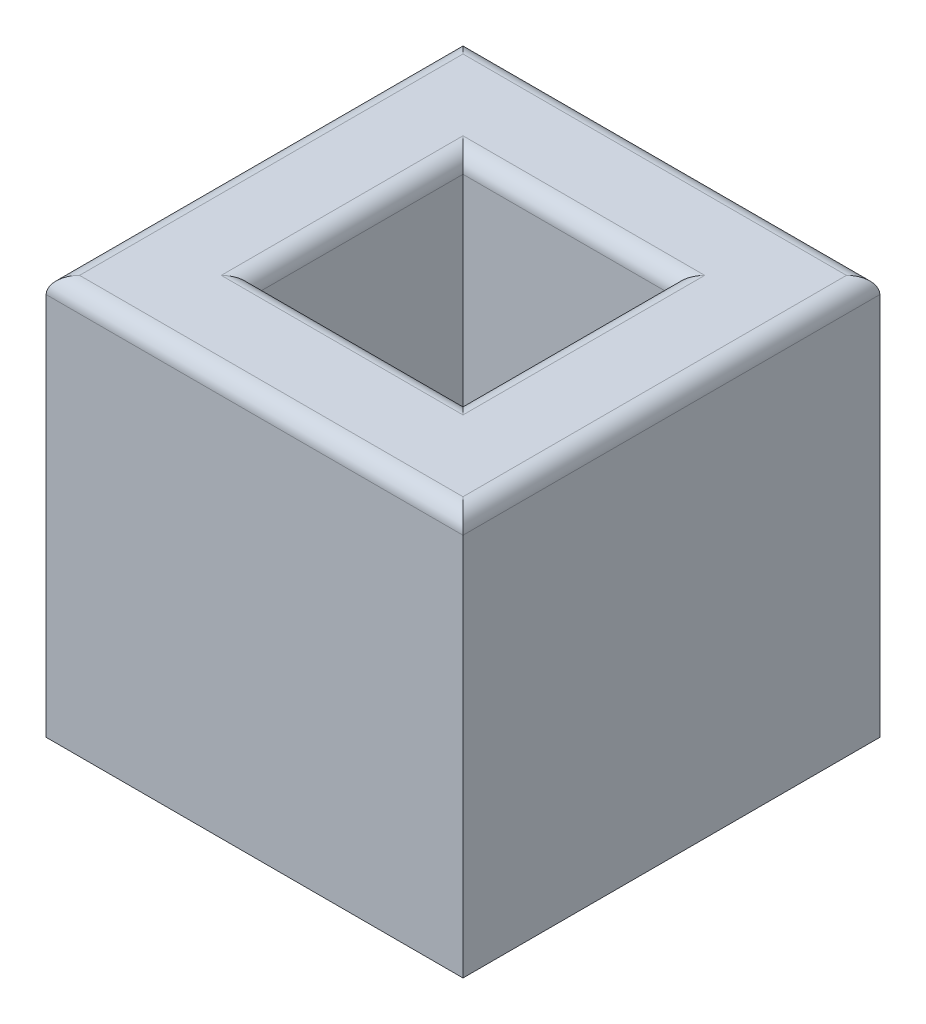
ISO-10303-21;
HEADER;
FILE_DESCRIPTION(('STEP AP214'),'2;1');
FILE_NAME('part.step','',(''),(''),'','','');
FILE_SCHEMA(('AUTOMOTIVE_DESIGN { 1 0 10303 214 1 1 1 1 }'));
ENDSEC;
DATA;
#1=APPLICATION_CONTEXT('core data for automotive mechanical design processes');
#2=APPLICATION_PROTOCOL_DEFINITION('international standard','automotive_design',2000,#1);
#3=PRODUCT_CONTEXT('',#1,'mechanical');
#4=PRODUCT('Part','Part','',(#3));
#5=PRODUCT_RELATED_PRODUCT_CATEGORY('part','',(#4));
#6=PRODUCT_DEFINITION_FORMATION('','',#4);
#7=PRODUCT_DEFINITION_CONTEXT('part definition',#1,'design');
#8=PRODUCT_DEFINITION('design','',#6,#7);
#9=PRODUCT_DEFINITION_SHAPE('','',#8);
#10=(LENGTH_UNIT() NAMED_UNIT(*) SI_UNIT(.MILLI.,.METRE.));
#11=(NAMED_UNIT(*) PLANE_ANGLE_UNIT() SI_UNIT($,.RADIAN.));
#12=(NAMED_UNIT(*) SI_UNIT($,.STERADIAN.) SOLID_ANGLE_UNIT());
#13=UNCERTAINTY_MEASURE_WITH_UNIT(LENGTH_MEASURE(1.E-05),#10,'distance_accuracy_value','');
#14=(GEOMETRIC_REPRESENTATION_CONTEXT(3) GLOBAL_UNCERTAINTY_ASSIGNED_CONTEXT((#13)) GLOBAL_UNIT_ASSIGNED_CONTEXT((#10,
#11,#12)) REPRESENTATION_CONTEXT('',''));
#15=CARTESIAN_POINT('',(0.,0.,0.));
#16=DIRECTION('',(0.,0.,1.));
#17=DIRECTION('',(1.,0.,0.));
#18=AXIS2_PLACEMENT_3D('',#15,#16,#17);
#19=CARTESIAN_POINT('',(63.5,127.,63.5));
#20=DIRECTION('',(-1.,0.,0.));
#21=DIRECTION('',(0.,0.,1.));
#22=AXIS2_PLACEMENT_3D('',#19,#20,#21);
#23=PLANE('',#22);
#24=DIRECTION('',(0.,-1.,0.));
#25=VECTOR('',#24,1.);
#26=CARTESIAN_POINT('',(63.5,127.,-63.5));
#27=LINE('',#26,#25);
#28=CARTESIAN_POINT('',(63.5,121.92,-63.5));
#29=VERTEX_POINT('',#28);
#30=CARTESIAN_POINT('',(63.5,5.08,-63.5));
#31=VERTEX_POINT('',#30);
#32=EDGE_CURVE('E161',#29,#31,#27,.T.);
#33=ORIENTED_EDGE('',*,*,#32,.F.);
#34=DIRECTION('',(0.,0.,-1.));
#35=VECTOR('',#34,1.);
#36=CARTESIAN_POINT('',(63.5,121.92,63.5));
#37=LINE('',#36,#35);
#38=CARTESIAN_POINT('',(63.5,121.92,63.5));
#39=VERTEX_POINT('',#38);
#40=EDGE_CURVE('E259',#29,#39,#37,.F.);
#41=ORIENTED_EDGE('',*,*,#40,.T.);
#42=DIRECTION('',(0.,-1.,0.));
#43=VECTOR('',#42,1.);
#44=CARTESIAN_POINT('',(63.5,127.,63.5));
#45=LINE('',#44,#43);
#46=CARTESIAN_POINT('',(63.5,5.08,63.5));
#47=VERTEX_POINT('',#46);
#48=EDGE_CURVE('E311',#39,#47,#45,.T.);
#49=ORIENTED_EDGE('',*,*,#48,.T.);
#50=DIRECTION('',(0.,0.,-1.));
#51=VECTOR('',#50,1.);
#52=CARTESIAN_POINT('',(63.5,5.08,-63.5));
#53=LINE('',#52,#51);
#54=EDGE_CURVE('E208',#47,#31,#53,.T.);
#55=ORIENTED_EDGE('',*,*,#54,.T.);
#56=EDGE_LOOP('',(#33,#41,#49,#55));
#57=FACE_BOUND('',#56,.T.);
#58=ADVANCED_FACE('F33',(#57),#23,.F.);
#59=CARTESIAN_POINT('',(-63.5,127.,-63.5));
#60=DIRECTION('',(0.,0.,1.));
#61=DIRECTION('',(1.,0.,0.));
#62=AXIS2_PLACEMENT_3D('',#59,#60,#61);
#63=PLANE('',#62);
#64=DIRECTION('',(0.,-1.,0.));
#65=VECTOR('',#64,1.);
#66=CARTESIAN_POINT('',(-63.5,127.,-63.5));
#67=LINE('',#66,#65);
#68=CARTESIAN_POINT('',(-63.5,121.92,-63.5));
#69=VERTEX_POINT('',#68);
#70=CARTESIAN_POINT('',(-63.5,5.08,-63.5));
#71=VERTEX_POINT('',#70);
#72=EDGE_CURVE('E149',#69,#71,#67,.T.);
#73=ORIENTED_EDGE('',*,*,#72,.F.);
#74=DIRECTION('',(-1.,0.,0.));
#75=VECTOR('',#74,1.);
#76=CARTESIAN_POINT('',(-63.5,121.92,-63.5));
#77=LINE('',#76,#75);
#78=EDGE_CURVE('E257',#69,#29,#77,.F.);
#79=ORIENTED_EDGE('',*,*,#78,.T.);
#80=ORIENTED_EDGE('',*,*,#32,.T.);
#81=DIRECTION('',(-1.,0.,0.));
#82=VECTOR('',#81,1.);
#83=CARTESIAN_POINT('',(-63.5,5.08,-63.5));
#84=LINE('',#83,#82);
#85=EDGE_CURVE('E170',#31,#71,#84,.T.);
#86=ORIENTED_EDGE('',*,*,#85,.T.);
#87=EDGE_LOOP('',(#73,#79,#80,#86));
#88=FACE_BOUND('',#87,.T.);
#89=ADVANCED_FACE('F184',(#88),#63,.F.);
#90=CARTESIAN_POINT('',(-63.5,127.,63.5));
#91=DIRECTION('',(1.,0.,0.));
#92=DIRECTION('',(0.,0.,-1.));
#93=AXIS2_PLACEMENT_3D('',#90,#91,#92);
#94=PLANE('',#93);
#95=DIRECTION('',(0.,-1.,0.));
#96=VECTOR('',#95,1.);
#97=CARTESIAN_POINT('',(-63.5,127.,63.5));
#98=LINE('',#97,#96);
#99=CARTESIAN_POINT('',(-63.5,121.92,63.5));
#100=VERTEX_POINT('',#99);
#101=CARTESIAN_POINT('',(-63.5,5.08,63.5));
#102=VERTEX_POINT('',#101);
#103=EDGE_CURVE('E162',#100,#102,#98,.T.);
#104=ORIENTED_EDGE('',*,*,#103,.F.);
#105=DIRECTION('',(0.,0.,1.));
#106=VECTOR('',#105,1.);
#107=CARTESIAN_POINT('',(-63.5,121.92,63.5));
#108=LINE('',#107,#106);
#109=EDGE_CURVE('E157',#100,#69,#108,.F.);
#110=ORIENTED_EDGE('',*,*,#109,.T.);
#111=ORIENTED_EDGE('',*,*,#72,.T.);
#112=DIRECTION('',(0.,0.,1.));
#113=VECTOR('',#112,1.);
#114=CARTESIAN_POINT('',(-63.5,5.08,63.5));
#115=LINE('',#114,#113);
#116=EDGE_CURVE('E154',#71,#102,#115,.T.);
#117=ORIENTED_EDGE('',*,*,#116,.T.);
#118=EDGE_LOOP('',(#104,#110,#111,#117));
#119=FACE_BOUND('',#118,.T.);
#120=ADVANCED_FACE('F152',(#119),#94,.F.);
#121=CARTESIAN_POINT('',(-63.5,127.,63.5));
#122=DIRECTION('',(0.,0.,-1.));
#123=DIRECTION('',(-1.,0.,0.));
#124=AXIS2_PLACEMENT_3D('',#121,#122,#123);
#125=PLANE('',#124);
#126=ORIENTED_EDGE('',*,*,#48,.F.);
#127=DIRECTION('',(1.,0.,0.));
#128=VECTOR('',#127,1.);
#129=CARTESIAN_POINT('',(-63.5,121.92,63.5));
#130=LINE('',#129,#128);
#131=EDGE_CURVE('E253',#39,#100,#130,.F.);
#132=ORIENTED_EDGE('',*,*,#131,.T.);
#133=ORIENTED_EDGE('',*,*,#103,.T.);
#134=DIRECTION('',(1.,0.,0.));
#135=VECTOR('',#134,1.);
#136=CARTESIAN_POINT('',(63.5,5.08,63.5));
#137=LINE('',#136,#135);
#138=EDGE_CURVE('E182',#102,#47,#137,.T.);
#139=ORIENTED_EDGE('',*,*,#138,.T.);
#140=EDGE_LOOP('',(#126,#132,#133,#139));
#141=FACE_BOUND('',#140,.T.);
#142=ADVANCED_FACE('F319',(#141),#125,.F.);
#143=CARTESIAN_POINT('',(0.,127.,0.));
#144=DIRECTION('',(0.,-1.,0.));
#145=DIRECTION('',(0.,0.,-1.));
#146=AXIS2_PLACEMENT_3D('',#143,#144,#145);
#147=PLANE('',#146);
#148=DIRECTION('',(0.,0.,1.));
#149=VECTOR('',#148,1.);
#150=CARTESIAN_POINT('',(-58.42,127.,0.));
#151=LINE('',#150,#149);
#152=CARTESIAN_POINT('',(-58.42,127.,-58.42));
#153=VERTEX_POINT('',#152);
#154=CARTESIAN_POINT('',(-58.42,127.,58.42));
#155=VERTEX_POINT('',#154);
#156=EDGE_CURVE('E248',#153,#155,#151,.T.);
#157=ORIENTED_EDGE('',*,*,#156,.T.);
#158=DIRECTION('',(1.,0.,0.));
#159=VECTOR('',#158,1.);
#160=CARTESIAN_POINT('',(0.,127.,58.42));
#161=LINE('',#160,#159);
#162=CARTESIAN_POINT('',(58.42,127.,58.42));
#163=VERTEX_POINT('',#162);
#164=EDGE_CURVE('E250',#155,#163,#161,.T.);
#165=ORIENTED_EDGE('',*,*,#164,.T.);
#166=DIRECTION('',(0.,0.,-1.));
#167=VECTOR('',#166,1.);
#168=CARTESIAN_POINT('',(58.42,127.,0.));
#169=LINE('',#168,#167);
#170=CARTESIAN_POINT('',(58.42,127.,-58.42));
#171=VERTEX_POINT('',#170);
#172=EDGE_CURVE('E244',#163,#171,#169,.T.);
#173=ORIENTED_EDGE('',*,*,#172,.T.);
#174=DIRECTION('',(-1.,0.,0.));
#175=VECTOR('',#174,1.);
#176=CARTESIAN_POINT('',(0.,127.,-58.42));
#177=LINE('',#176,#175);
#178=EDGE_CURVE('E246',#171,#153,#177,.T.);
#179=ORIENTED_EDGE('',*,*,#178,.T.);
#180=EDGE_LOOP('',(#157,#165,#173,#179));
#181=FACE_BOUND('',#180,.T.);
#182=DIRECTION('',(1.,0.,0.));
#183=VECTOR('',#182,1.);
#184=CARTESIAN_POINT('',(0.,127.,36.83));
#185=LINE('',#184,#183);
#186=CARTESIAN_POINT('',(36.83,127.,36.83));
#187=VERTEX_POINT('',#186);
#188=CARTESIAN_POINT('',(-36.83,127.,36.83));
#189=VERTEX_POINT('',#188);
#190=EDGE_CURVE('E239',#187,#189,#185,.F.);
#191=ORIENTED_EDGE('',*,*,#190,.T.);
#192=DIRECTION('',(0.,0.,1.));
#193=VECTOR('',#192,1.);
#194=CARTESIAN_POINT('',(-36.83,127.,0.));
#195=LINE('',#194,#193);
#196=CARTESIAN_POINT('',(-36.83,127.,-36.83));
#197=VERTEX_POINT('',#196);
#198=EDGE_CURVE('E241',#189,#197,#195,.F.);
#199=ORIENTED_EDGE('',*,*,#198,.T.);
#200=DIRECTION('',(-1.,0.,0.));
#201=VECTOR('',#200,1.);
#202=CARTESIAN_POINT('',(0.,127.,-36.83));
#203=LINE('',#202,#201);
#204=CARTESIAN_POINT('',(36.83,127.,-36.83));
#205=VERTEX_POINT('',#204);
#206=EDGE_CURVE('E218',#197,#205,#203,.F.);
#207=ORIENTED_EDGE('',*,*,#206,.T.);
#208=DIRECTION('',(0.,0.,-1.));
#209=VECTOR('',#208,1.);
#210=CARTESIAN_POINT('',(36.83,127.,0.));
#211=LINE('',#210,#209);
#212=EDGE_CURVE('E237',#205,#187,#211,.F.);
#213=ORIENTED_EDGE('',*,*,#212,.T.);
#214=EDGE_LOOP('',(#191,#199,#207,#213));
#215=FACE_BOUND('',#214,.T.);
#216=ADVANCED_FACE('F293',(#181,#215),#147,.F.);
#217=CARTESIAN_POINT('',(0.,0.,0.));
#218=DIRECTION('',(0.,-1.,0.));
#219=DIRECTION('',(0.,0.,-1.));
#220=AXIS2_PLACEMENT_3D('',#217,#218,#219);
#221=PLANE('',#220);
#222=DIRECTION('',(0.,0.,-1.));
#223=VECTOR('',#222,1.);
#224=CARTESIAN_POINT('',(-58.42,0.,-63.5));
#225=LINE('',#224,#223);
#226=CARTESIAN_POINT('',(-58.42,0.,58.42));
#227=VERTEX_POINT('',#226);
#228=CARTESIAN_POINT('',(-58.42,0.,-58.42));
#229=VERTEX_POINT('',#228);
#230=EDGE_CURVE('E203',#227,#229,#225,.T.);
#231=ORIENTED_EDGE('',*,*,#230,.T.);
#232=DIRECTION('',(1.,0.,0.));
#233=VECTOR('',#232,1.);
#234=CARTESIAN_POINT('',(63.5,0.,-58.42));
#235=LINE('',#234,#233);
#236=CARTESIAN_POINT('',(58.42,0.,-58.42));
#237=VERTEX_POINT('',#236);
#238=EDGE_CURVE('E172',#229,#237,#235,.T.);
#239=ORIENTED_EDGE('',*,*,#238,.T.);
#240=DIRECTION('',(0.,0.,1.));
#241=VECTOR('',#240,1.);
#242=CARTESIAN_POINT('',(58.42,0.,63.5));
#243=LINE('',#242,#241);
#244=CARTESIAN_POINT('',(58.42,0.,58.42));
#245=VERTEX_POINT('',#244);
#246=EDGE_CURVE('E199',#237,#245,#243,.T.);
#247=ORIENTED_EDGE('',*,*,#246,.T.);
#248=DIRECTION('',(-1.,0.,0.));
#249=VECTOR('',#248,1.);
#250=CARTESIAN_POINT('',(-63.5,0.,58.42));
#251=LINE('',#250,#249);
#252=EDGE_CURVE('E201',#245,#227,#251,.T.);
#253=ORIENTED_EDGE('',*,*,#252,.T.);
#254=EDGE_LOOP('',(#231,#239,#247,#253));
#255=FACE_BOUND('',#254,.T.);
#256=DIRECTION('',(0.,0.,1.));
#257=VECTOR('',#256,1.);
#258=CARTESIAN_POINT('',(-36.83,0.,31.75));
#259=LINE('',#258,#257);
#260=CARTESIAN_POINT('',(-36.83,0.,-36.83));
#261=VERTEX_POINT('',#260);
#262=CARTESIAN_POINT('',(-36.83,0.,36.83));
#263=VERTEX_POINT('',#262);
#264=EDGE_CURVE('E194',#261,#263,#259,.T.);
#265=ORIENTED_EDGE('',*,*,#264,.T.);
#266=DIRECTION('',(1.,0.,0.));
#267=VECTOR('',#266,1.);
#268=CARTESIAN_POINT('',(31.75,0.,36.83));
#269=LINE('',#268,#267);
#270=CARTESIAN_POINT('',(36.83,0.,36.83));
#271=VERTEX_POINT('',#270);
#272=EDGE_CURVE('E196',#263,#271,#269,.T.);
#273=ORIENTED_EDGE('',*,*,#272,.T.);
#274=DIRECTION('',(0.,0.,-1.));
#275=VECTOR('',#274,1.);
#276=CARTESIAN_POINT('',(36.83,0.,-31.75));
#277=LINE('',#276,#275);
#278=CARTESIAN_POINT('',(36.83,0.,-36.83));
#279=VERTEX_POINT('',#278);
#280=EDGE_CURVE('E187',#271,#279,#277,.T.);
#281=ORIENTED_EDGE('',*,*,#280,.T.);
#282=DIRECTION('',(-1.,0.,0.));
#283=VECTOR('',#282,1.);
#284=CARTESIAN_POINT('',(-31.75,0.,-36.83));
#285=LINE('',#284,#283);
#286=EDGE_CURVE('E189',#279,#261,#285,.T.);
#287=ORIENTED_EDGE('',*,*,#286,.T.);
#288=EDGE_LOOP('',(#265,#273,#281,#287));
#289=FACE_BOUND('',#288,.T.);
#290=ADVANCED_FACE('F348',(#255,#289),#221,.T.);
#291=CARTESIAN_POINT('',(31.75,0.,31.75));
#292=DIRECTION('',(1.,0.,0.));
#293=DIRECTION('',(0.,0.,-1.));
#294=AXIS2_PLACEMENT_3D('',#291,#292,#293);
#295=PLANE('',#294);
#296=DIRECTION('',(0.,1.,0.));
#297=VECTOR('',#296,1.);
#298=CARTESIAN_POINT('',(31.75,0.,31.75));
#299=LINE('',#298,#297);
#300=CARTESIAN_POINT('',(31.75,5.08000000000006,31.75));
#301=VERTEX_POINT('',#300);
#302=CARTESIAN_POINT('',(31.75,121.92,31.75));
#303=VERTEX_POINT('',#302);
#304=EDGE_CURVE('E309',#301,#303,#299,.T.);
#305=ORIENTED_EDGE('',*,*,#304,.T.);
#306=DIRECTION('',(0.,0.,-1.));
#307=VECTOR('',#306,1.);
#308=CARTESIAN_POINT('',(31.75,121.92,31.75));
#309=LINE('',#308,#307);
#310=CARTESIAN_POINT('',(31.75,121.92,-31.75));
#311=VERTEX_POINT('',#310);
#312=EDGE_CURVE('E42',#303,#311,#309,.T.);
#313=ORIENTED_EDGE('',*,*,#312,.T.);
#314=DIRECTION('',(0.,1.,0.));
#315=VECTOR('',#314,1.);
#316=CARTESIAN_POINT('',(31.75,0.,-31.75));
#317=LINE('',#316,#315);
#318=CARTESIAN_POINT('',(31.75,5.08000000000006,-31.75));
#319=VERTEX_POINT('',#318);
#320=EDGE_CURVE('E225',#319,#311,#317,.T.);
#321=ORIENTED_EDGE('',*,*,#320,.F.);
#322=DIRECTION('',(0.,0.,1.));
#323=VECTOR('',#322,1.);
#324=CARTESIAN_POINT('',(31.75,5.08000000000006,31.75));
#325=LINE('',#324,#323);
#326=EDGE_CURVE('E217',#319,#301,#325,.T.);
#327=ORIENTED_EDGE('',*,*,#326,.T.);
#328=EDGE_LOOP('',(#305,#313,#321,#327));
#329=FACE_BOUND('',#328,.T.);
#330=ADVANCED_FACE('F516',(#329),#295,.F.);
#331=CARTESIAN_POINT('',(-31.75,0.,31.75));
#332=DIRECTION('',(0.,0.,1.));
#333=DIRECTION('',(1.,0.,0.));
#334=AXIS2_PLACEMENT_3D('',#331,#332,#333);
#335=PLANE('',#334);
#336=DIRECTION('',(0.,1.,0.));
#337=VECTOR('',#336,1.);
#338=CARTESIAN_POINT('',(-31.75,0.,31.75));
#339=LINE('',#338,#337);
#340=CARTESIAN_POINT('',(-31.75,5.08000000000006,31.75));
#341=VERTEX_POINT('',#340);
#342=CARTESIAN_POINT('',(-31.75,121.92,31.75));
#343=VERTEX_POINT('',#342);
#344=EDGE_CURVE('E304',#341,#343,#339,.T.);
#345=ORIENTED_EDGE('',*,*,#344,.T.);
#346=DIRECTION('',(1.,0.,0.));
#347=VECTOR('',#346,1.);
#348=CARTESIAN_POINT('',(-31.75,121.92,31.75));
#349=LINE('',#348,#347);
#350=EDGE_CURVE('E57',#343,#303,#349,.T.);
#351=ORIENTED_EDGE('',*,*,#350,.T.);
#352=ORIENTED_EDGE('',*,*,#304,.F.);
#353=DIRECTION('',(-1.,0.,0.));
#354=VECTOR('',#353,1.);
#355=CARTESIAN_POINT('',(-31.75,5.08000000000006,31.75));
#356=LINE('',#355,#354);
#357=EDGE_CURVE('E210',#301,#341,#356,.T.);
#358=ORIENTED_EDGE('',*,*,#357,.T.);
#359=EDGE_LOOP('',(#345,#351,#352,#358));
#360=FACE_BOUND('',#359,.T.);
#361=ADVANCED_FACE('F307',(#360),#335,.F.);
#362=CARTESIAN_POINT('',(-31.75,0.,31.75));
#363=DIRECTION('',(-1.,0.,0.));
#364=DIRECTION('',(0.,0.,1.));
#365=AXIS2_PLACEMENT_3D('',#362,#363,#364);
#366=PLANE('',#365);
#367=DIRECTION('',(0.,1.,0.));
#368=VECTOR('',#367,1.);
#369=CARTESIAN_POINT('',(-31.75,0.,-31.75));
#370=LINE('',#369,#368);
#371=CARTESIAN_POINT('',(-31.75,5.08000000000006,-31.75));
#372=VERTEX_POINT('',#371);
#373=CARTESIAN_POINT('',(-31.75,121.92,-31.75));
#374=VERTEX_POINT('',#373);
#375=EDGE_CURVE('E306',#372,#374,#370,.T.);
#376=ORIENTED_EDGE('',*,*,#375,.T.);
#377=DIRECTION('',(0.,0.,1.));
#378=VECTOR('',#377,1.);
#379=CARTESIAN_POINT('',(-31.75,121.92,31.75));
#380=LINE('',#379,#378);
#381=EDGE_CURVE('E261',#374,#343,#380,.T.);
#382=ORIENTED_EDGE('',*,*,#381,.T.);
#383=ORIENTED_EDGE('',*,*,#344,.F.);
#384=DIRECTION('',(0.,0.,-1.));
#385=VECTOR('',#384,1.);
#386=CARTESIAN_POINT('',(-31.75,5.08000000000006,-31.75));
#387=LINE('',#386,#385);
#388=EDGE_CURVE('E213',#341,#372,#387,.T.);
#389=ORIENTED_EDGE('',*,*,#388,.T.);
#390=EDGE_LOOP('',(#376,#382,#383,#389));
#391=FACE_BOUND('',#390,.T.);
#392=ADVANCED_FACE('F303',(#391),#366,.F.);
#393=CARTESIAN_POINT('',(-31.75,0.,-31.75));
#394=DIRECTION('',(0.,0.,-1.));
#395=DIRECTION('',(-1.,0.,0.));
#396=AXIS2_PLACEMENT_3D('',#393,#394,#395);
#397=PLANE('',#396);
#398=ORIENTED_EDGE('',*,*,#320,.T.);
#399=DIRECTION('',(-1.,0.,0.));
#400=VECTOR('',#399,1.);
#401=CARTESIAN_POINT('',(-31.75,121.92,-31.75));
#402=LINE('',#401,#400);
#403=EDGE_CURVE('E11',#311,#374,#402,.T.);
#404=ORIENTED_EDGE('',*,*,#403,.T.);
#405=ORIENTED_EDGE('',*,*,#375,.F.);
#406=DIRECTION('',(1.,0.,0.));
#407=VECTOR('',#406,1.);
#408=CARTESIAN_POINT('',(31.75,5.08000000000006,-31.75));
#409=LINE('',#408,#407);
#410=EDGE_CURVE('E215',#372,#319,#409,.T.);
#411=ORIENTED_EDGE('',*,*,#410,.T.);
#412=EDGE_LOOP('',(#398,#404,#405,#411));
#413=FACE_BOUND('',#412,.T.);
#414=ADVANCED_FACE('F353',(#413),#397,.F.);
#415=CARTESIAN_POINT('',(-63.5,5.08,63.5));
#416=DIRECTION('',(0.,-0.70710678118655,0.707106781186546));
#417=DIRECTION('',(-1.,0.,0.));
#418=AXIS2_PLACEMENT_3D('',#415,#416,#417);
#419=PLANE('',#418);
#420=DIRECTION('',(0.577350269189627,-0.577350269189624,-0.577350269189627));
#421=VECTOR('',#420,1.);
#422=CARTESIAN_POINT('',(-63.5,5.08,63.5));
#423=LINE('',#422,#421);
#424=EDGE_CURVE('E181',#227,#102,#423,.F.);
#425=ORIENTED_EDGE('',*,*,#424,.F.);
#426=ORIENTED_EDGE('',*,*,#252,.F.);
#427=DIRECTION('',(-0.577350269189627,-0.577350269189624,-0.577350269189627));
#428=VECTOR('',#427,1.);
#429=CARTESIAN_POINT('',(63.5,5.08,63.5));
#430=LINE('',#429,#428);
#431=EDGE_CURVE('E222',#47,#245,#430,.T.);
#432=ORIENTED_EDGE('',*,*,#431,.F.);
#433=ORIENTED_EDGE('',*,*,#138,.F.);
#434=EDGE_LOOP('',(#425,#426,#432,#433));
#435=FACE_BOUND('',#434,.T.);
#436=ADVANCED_FACE('F351',(#435),#419,.T.);
#437=CARTESIAN_POINT('',(63.5,5.08,63.5));
#438=DIRECTION('',(0.707106781186546,-0.70710678118655,0.));
#439=DIRECTION('',(0.,0.,1.));
#440=AXIS2_PLACEMENT_3D('',#437,#438,#439);
#441=PLANE('',#440);
#442=ORIENTED_EDGE('',*,*,#431,.T.);
#443=ORIENTED_EDGE('',*,*,#246,.F.);
#444=DIRECTION('',(0.577350269189627,0.577350269189624,-0.577350269189627));
#445=VECTOR('',#444,1.);
#446=CARTESIAN_POINT('',(21.1666666666665,-37.2533333333333,-21.1666666666665));
#447=LINE('',#446,#445);
#448=EDGE_CURVE('E175',#31,#237,#447,.F.);
#449=ORIENTED_EDGE('',*,*,#448,.F.);
#450=ORIENTED_EDGE('',*,*,#54,.F.);
#451=EDGE_LOOP('',(#442,#443,#449,#450));
#452=FACE_BOUND('',#451,.T.);
#453=ADVANCED_FACE('F345',(#452),#441,.T.);
#454=CARTESIAN_POINT('',(-63.5,5.08,63.5));
#455=DIRECTION('',(-0.707106781186546,-0.70710678118655,0.));
#456=DIRECTION('',(0.,0.,-1.));
#457=AXIS2_PLACEMENT_3D('',#454,#455,#456);
#458=PLANE('',#457);
#459=ORIENTED_EDGE('',*,*,#424,.T.);
#460=ORIENTED_EDGE('',*,*,#116,.F.);
#461=DIRECTION('',(0.577350269189627,-0.577350269189624,0.577350269189627));
#462=VECTOR('',#461,1.);
#463=CARTESIAN_POINT('',(-21.1666666666665,-37.2533333333333,-21.1666666666665));
#464=LINE('',#463,#462);
#465=EDGE_CURVE('E168',#229,#71,#464,.F.);
#466=ORIENTED_EDGE('',*,*,#465,.F.);
#467=ORIENTED_EDGE('',*,*,#230,.F.);
#468=EDGE_LOOP('',(#459,#460,#466,#467));
#469=FACE_BOUND('',#468,.T.);
#470=ADVANCED_FACE('F179',(#469),#458,.T.);
#471=CARTESIAN_POINT('',(-63.5,5.08,-63.5));
#472=DIRECTION('',(0.,-0.70710678118655,-0.707106781186546));
#473=DIRECTION('',(1.,0.,0.));
#474=AXIS2_PLACEMENT_3D('',#471,#472,#473);
#475=PLANE('',#474);
#476=ORIENTED_EDGE('',*,*,#448,.T.);
#477=ORIENTED_EDGE('',*,*,#238,.F.);
#478=ORIENTED_EDGE('',*,*,#465,.T.);
#479=ORIENTED_EDGE('',*,*,#85,.F.);
#480=EDGE_LOOP('',(#476,#477,#478,#479));
#481=FACE_BOUND('',#480,.T.);
#482=ADVANCED_FACE('F169',(#481),#475,.T.);
#483=CARTESIAN_POINT('',(0.,0.,-36.83));
#484=DIRECTION('',(0.,-0.707106781186544,0.707106781186551));
#485=DIRECTION('',(1.,0.,0.));
#486=AXIS2_PLACEMENT_3D('',#483,#484,#485);
#487=PLANE('',#486);
#488=DIRECTION('',(0.577350269189624,-0.57735026918963,-0.577350269189624));
#489=VECTOR('',#488,1.);
#490=CARTESIAN_POINT('',(24.5533333333334,12.2766666666667,-24.5533333333334));
#491=LINE('',#490,#489);
#492=EDGE_CURVE('E231',#319,#279,#491,.T.);
#493=ORIENTED_EDGE('',*,*,#492,.F.);
#494=ORIENTED_EDGE('',*,*,#410,.F.);
#495=DIRECTION('',(-0.577350269189624,-0.57735026918963,-0.577350269189624));
#496=VECTOR('',#495,1.);
#497=CARTESIAN_POINT('',(-24.5533333333334,12.2766666666667,-24.5533333333334));
#498=LINE('',#497,#496);
#499=EDGE_CURVE('E176',#261,#372,#498,.F.);
#500=ORIENTED_EDGE('',*,*,#499,.F.);
#501=ORIENTED_EDGE('',*,*,#286,.F.);
#502=EDGE_LOOP('',(#493,#494,#500,#501));
#503=FACE_BOUND('',#502,.T.);
#504=ADVANCED_FACE('F373',(#503),#487,.T.);
#505=CARTESIAN_POINT('',(-36.83,0.,0.));
#506=DIRECTION('',(0.707106781186551,-0.707106781186544,0.));
#507=DIRECTION('',(0.,0.,-1.));
#508=AXIS2_PLACEMENT_3D('',#505,#506,#507);
#509=PLANE('',#508);
#510=ORIENTED_EDGE('',*,*,#499,.T.);
#511=ORIENTED_EDGE('',*,*,#388,.F.);
#512=DIRECTION('',(-0.577350269189624,-0.57735026918963,0.577350269189624));
#513=VECTOR('',#512,1.);
#514=CARTESIAN_POINT('',(-24.5533333333334,12.2766666666667,24.5533333333334));
#515=LINE('',#514,#513);
#516=EDGE_CURVE('E228',#263,#341,#515,.F.);
#517=ORIENTED_EDGE('',*,*,#516,.F.);
#518=ORIENTED_EDGE('',*,*,#264,.F.);
#519=EDGE_LOOP('',(#510,#511,#517,#518));
#520=FACE_BOUND('',#519,.T.);
#521=ADVANCED_FACE('F389',(#520),#509,.T.);
#522=CARTESIAN_POINT('',(36.83,0.,0.));
#523=DIRECTION('',(-0.707106781186551,-0.707106781186544,0.));
#524=DIRECTION('',(0.,0.,1.));
#525=AXIS2_PLACEMENT_3D('',#522,#523,#524);
#526=PLANE('',#525);
#527=ORIENTED_EDGE('',*,*,#492,.T.);
#528=ORIENTED_EDGE('',*,*,#280,.F.);
#529=DIRECTION('',(-0.577350269189624,0.57735026918963,-0.577350269189624));
#530=VECTOR('',#529,1.);
#531=CARTESIAN_POINT('',(24.5533333333334,12.2766666666667,24.5533333333334));
#532=LINE('',#531,#530);
#533=EDGE_CURVE('E226',#301,#271,#532,.F.);
#534=ORIENTED_EDGE('',*,*,#533,.F.);
#535=ORIENTED_EDGE('',*,*,#326,.F.);
#536=EDGE_LOOP('',(#527,#528,#534,#535));
#537=FACE_BOUND('',#536,.T.);
#538=ADVANCED_FACE('F397',(#537),#526,.T.);
#539=CARTESIAN_POINT('',(0.,0.,36.83));
#540=DIRECTION('',(0.,-0.707106781186544,-0.707106781186551));
#541=DIRECTION('',(-1.,0.,0.));
#542=AXIS2_PLACEMENT_3D('',#539,#540,#541);
#543=PLANE('',#542);
#544=ORIENTED_EDGE('',*,*,#516,.T.);
#545=ORIENTED_EDGE('',*,*,#357,.F.);
#546=ORIENTED_EDGE('',*,*,#533,.T.);
#547=ORIENTED_EDGE('',*,*,#272,.F.);
#548=EDGE_LOOP('',(#544,#545,#546,#547));
#549=FACE_BOUND('',#548,.T.);
#550=ADVANCED_FACE('F405',(#549),#543,.T.);
#551=CARTESIAN_POINT('',(0.,121.92,-58.42));
#552=DIRECTION('',(-1.,0.,0.));
#553=DIRECTION('',(0.,0.,1.));
#554=AXIS2_PLACEMENT_3D('',#551,#552,#553);
#555=CYLINDRICAL_SURFACE('',#554,5.08);
#556=CARTESIAN_POINT('',(58.42,121.92,-58.42));
#557=DIRECTION('',(-0.707106781186547,0.,-0.707106781186547));
#558=DIRECTION('',(0.707106781186547,0.,-0.707106781186547));
#559=AXIS2_PLACEMENT_3D('',#556,#557,#558);
#560=ELLIPSE('',#559,7.18420489685532,5.08);
#561=EDGE_CURVE('E270',#29,#171,#560,.F.);
#562=ORIENTED_EDGE('',*,*,#561,.F.);
#563=ORIENTED_EDGE('',*,*,#78,.F.);
#564=CARTESIAN_POINT('',(-58.42,121.92,-58.42));
#565=DIRECTION('',(-0.707106781186547,0.,0.707106781186547));
#566=DIRECTION('',(-0.707106781186547,0.,-0.707106781186547));
#567=AXIS2_PLACEMENT_3D('',#564,#565,#566);
#568=ELLIPSE('',#567,7.18420489685532,5.08);
#569=EDGE_CURVE('E229',#153,#69,#568,.T.);
#570=ORIENTED_EDGE('',*,*,#569,.F.);
#571=ORIENTED_EDGE('',*,*,#178,.F.);
#572=EDGE_LOOP('',(#562,#563,#570,#571));
#573=FACE_BOUND('',#572,.T.);
#574=ADVANCED_FACE('F339',(#573),#555,.T.);
#575=CARTESIAN_POINT('',(-58.42,121.92,0.));
#576=DIRECTION('',(0.,0.,1.));
#577=DIRECTION('',(1.,0.,0.));
#578=AXIS2_PLACEMENT_3D('',#575,#576,#577);
#579=CYLINDRICAL_SURFACE('',#578,5.08);
#580=ORIENTED_EDGE('',*,*,#569,.T.);
#581=ORIENTED_EDGE('',*,*,#109,.F.);
#582=CARTESIAN_POINT('',(-58.42,121.92,58.42));
#583=DIRECTION('',(0.707106781186547,0.,0.707106781186547));
#584=DIRECTION('',(-0.707106781186547,0.,0.707106781186547));
#585=AXIS2_PLACEMENT_3D('',#582,#583,#584);
#586=ELLIPSE('',#585,7.18420489685532,5.08);
#587=EDGE_CURVE('E268',#155,#100,#586,.T.);
#588=ORIENTED_EDGE('',*,*,#587,.F.);
#589=ORIENTED_EDGE('',*,*,#156,.F.);
#590=EDGE_LOOP('',(#580,#581,#588,#589));
#591=FACE_BOUND('',#590,.T.);
#592=ADVANCED_FACE('F337',(#591),#579,.T.);
#593=CARTESIAN_POINT('',(58.42,121.92,0.));
#594=DIRECTION('',(0.,0.,-1.));
#595=DIRECTION('',(-1.,0.,0.));
#596=AXIS2_PLACEMENT_3D('',#593,#594,#595);
#597=CYLINDRICAL_SURFACE('',#596,5.08);
#598=ORIENTED_EDGE('',*,*,#561,.T.);
#599=ORIENTED_EDGE('',*,*,#172,.F.);
#600=CARTESIAN_POINT('',(58.42,121.92,58.42));
#601=DIRECTION('',(0.707106781186547,0.,-0.707106781186547));
#602=DIRECTION('',(-0.707106781186547,0.,-0.707106781186547));
#603=AXIS2_PLACEMENT_3D('',#600,#601,#602);
#604=ELLIPSE('',#603,7.18420489685532,5.08);
#605=EDGE_CURVE('E266',#39,#163,#604,.F.);
#606=ORIENTED_EDGE('',*,*,#605,.F.);
#607=ORIENTED_EDGE('',*,*,#40,.F.);
#608=EDGE_LOOP('',(#598,#599,#606,#607));
#609=FACE_BOUND('',#608,.T.);
#610=ADVANCED_FACE('F330',(#609),#597,.T.);
#611=CARTESIAN_POINT('',(0.,121.92,58.42));
#612=DIRECTION('',(1.,0.,0.));
#613=DIRECTION('',(0.,0.,-1.));
#614=AXIS2_PLACEMENT_3D('',#611,#612,#613);
#615=CYLINDRICAL_SURFACE('',#614,5.08);
#616=ORIENTED_EDGE('',*,*,#587,.T.);
#617=ORIENTED_EDGE('',*,*,#131,.F.);
#618=ORIENTED_EDGE('',*,*,#605,.T.);
#619=ORIENTED_EDGE('',*,*,#164,.F.);
#620=EDGE_LOOP('',(#616,#617,#618,#619));
#621=FACE_BOUND('',#620,.T.);
#622=ADVANCED_FACE('F324',(#621),#615,.T.);
#623=CARTESIAN_POINT('',(36.83,121.92,31.75));
#624=DIRECTION('',(0.,0.,-1.));
#625=DIRECTION('',(-1.,0.,0.));
#626=AXIS2_PLACEMENT_3D('',#623,#624,#625);
#627=CYLINDRICAL_SURFACE('',#626,5.08);
#628=CARTESIAN_POINT('',(36.83,121.92,36.83));
#629=DIRECTION('',(0.707106781186547,0.,-0.707106781186547));
#630=DIRECTION('',(0.707106781186547,0.,0.707106781186547));
#631=AXIS2_PLACEMENT_3D('',#628,#629,#630);
#632=ELLIPSE('',#631,7.18420489685532,5.08);
#633=EDGE_CURVE('E278',#187,#303,#632,.F.);
#634=ORIENTED_EDGE('',*,*,#633,.F.);
#635=ORIENTED_EDGE('',*,*,#212,.F.);
#636=CARTESIAN_POINT('',(36.83,121.92,-36.83));
#637=DIRECTION('',(-0.707106781186547,0.,-0.707106781186547));
#638=DIRECTION('',(0.707106781186547,0.,-0.707106781186547));
#639=AXIS2_PLACEMENT_3D('',#636,#637,#638);
#640=ELLIPSE('',#639,7.18420489685532,5.08);
#641=EDGE_CURVE('E37',#311,#205,#640,.T.);
#642=ORIENTED_EDGE('',*,*,#641,.F.);
#643=ORIENTED_EDGE('',*,*,#312,.F.);
#644=EDGE_LOOP('',(#634,#635,#642,#643));
#645=FACE_BOUND('',#644,.T.);
#646=ADVANCED_FACE('F35',(#645),#627,.T.);
#647=CARTESIAN_POINT('',(-31.75,121.92,-36.83));
#648=DIRECTION('',(-1.,0.,0.));
#649=DIRECTION('',(0.,0.,1.));
#650=AXIS2_PLACEMENT_3D('',#647,#648,#649);
#651=CYLINDRICAL_SURFACE('',#650,5.08);
#652=ORIENTED_EDGE('',*,*,#641,.T.);
#653=ORIENTED_EDGE('',*,*,#206,.F.);
#654=CARTESIAN_POINT('',(-36.83,121.92,-36.83));
#655=DIRECTION('',(-0.707106781186547,0.,0.707106781186547));
#656=DIRECTION('',(0.707106781186547,0.,0.707106781186547));
#657=AXIS2_PLACEMENT_3D('',#654,#655,#656);
#658=ELLIPSE('',#657,7.18420489685532,5.08);
#659=EDGE_CURVE('E277',#374,#197,#658,.T.);
#660=ORIENTED_EDGE('',*,*,#659,.F.);
#661=ORIENTED_EDGE('',*,*,#403,.F.);
#662=EDGE_LOOP('',(#652,#653,#660,#661));
#663=FACE_BOUND('',#662,.T.);
#664=ADVANCED_FACE('F288',(#663),#651,.T.);
#665=CARTESIAN_POINT('',(-31.75,121.92,36.83));
#666=DIRECTION('',(1.,0.,0.));
#667=DIRECTION('',(0.,0.,-1.));
#668=AXIS2_PLACEMENT_3D('',#665,#666,#667);
#669=CYLINDRICAL_SURFACE('',#668,5.08);
#670=ORIENTED_EDGE('',*,*,#633,.T.);
#671=ORIENTED_EDGE('',*,*,#350,.F.);
#672=CARTESIAN_POINT('',(-36.83,121.92,36.83));
#673=DIRECTION('',(0.707106781186547,0.,0.707106781186547));
#674=DIRECTION('',(-0.707106781186547,0.,0.707106781186547));
#675=AXIS2_PLACEMENT_3D('',#672,#673,#674);
#676=ELLIPSE('',#675,7.18420489685532,5.08);
#677=EDGE_CURVE('E275',#189,#343,#676,.F.);
#678=ORIENTED_EDGE('',*,*,#677,.F.);
#679=ORIENTED_EDGE('',*,*,#190,.F.);
#680=EDGE_LOOP('',(#670,#671,#678,#679));
#681=FACE_BOUND('',#680,.T.);
#682=ADVANCED_FACE('F299',(#681),#669,.T.);
#683=CARTESIAN_POINT('',(-36.83,121.92,31.75));
#684=DIRECTION('',(0.,0.,1.));
#685=DIRECTION('',(1.,0.,0.));
#686=AXIS2_PLACEMENT_3D('',#683,#684,#685);
#687=CYLINDRICAL_SURFACE('',#686,5.08);
#688=ORIENTED_EDGE('',*,*,#659,.T.);
#689=ORIENTED_EDGE('',*,*,#198,.F.);
#690=ORIENTED_EDGE('',*,*,#677,.T.);
#691=ORIENTED_EDGE('',*,*,#381,.F.);
#692=EDGE_LOOP('',(#688,#689,#690,#691));
#693=FACE_BOUND('',#692,.T.);
#694=ADVANCED_FACE('F297',(#693),#687,.T.);
#695=CLOSED_SHELL('',(#58,#89,#120,#142,#216,#290,#330,#361,#392,#414,#436,#453,#470,#482,#504,
#521,#538,#550,#574,#592,#610,#622,#646,#664,#682,#694));
#696=MANIFOLD_SOLID_BREP('B2',#695);
#697=ADVANCED_BREP_SHAPE_REPRESENTATION('',(#18,#696),#14);
#698=SHAPE_DEFINITION_REPRESENTATION(#9,#697);
ENDSEC;
END-ISO-10303-21;
